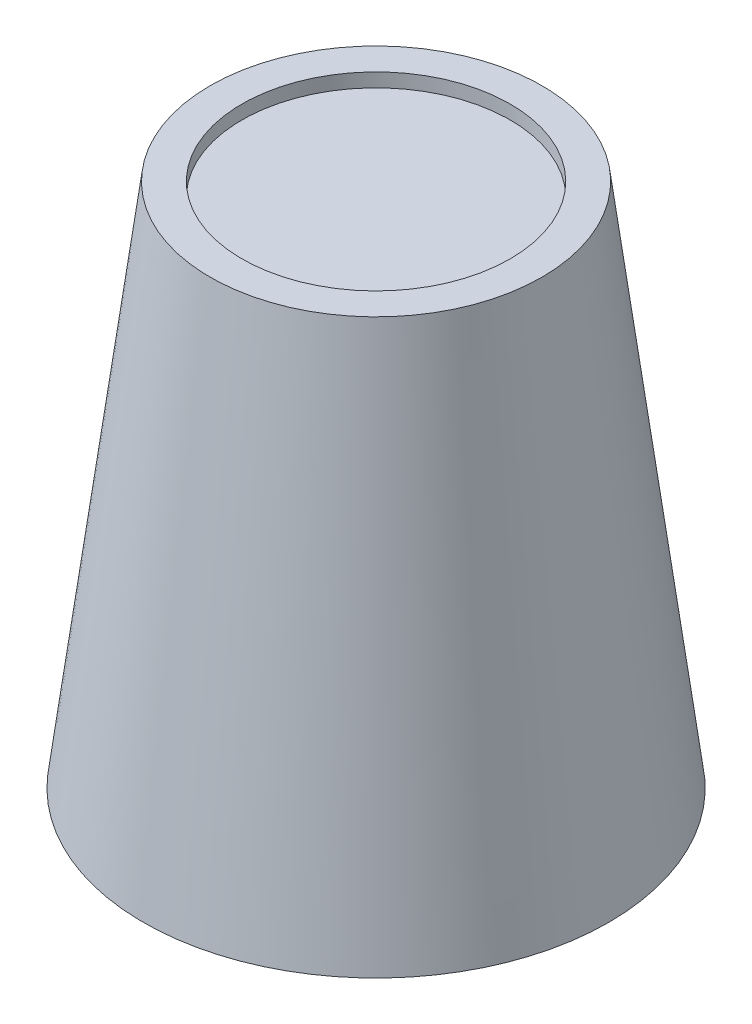
ISO-10303-21;
HEADER;
FILE_DESCRIPTION(('STEP AP214'),'2;1');
FILE_NAME('part.step','',(''),(''),'','','');
FILE_SCHEMA(('AUTOMOTIVE_DESIGN { 1 0 10303 214 1 1 1 1 }'));
ENDSEC;
DATA;
#1=APPLICATION_CONTEXT('core data for automotive mechanical design processes');
#2=APPLICATION_PROTOCOL_DEFINITION('international standard','automotive_design',2000,#1);
#3=PRODUCT_CONTEXT('',#1,'mechanical');
#4=PRODUCT('Part','Part','',(#3));
#5=PRODUCT_RELATED_PRODUCT_CATEGORY('part','',(#4));
#6=PRODUCT_DEFINITION_FORMATION('','',#4);
#7=PRODUCT_DEFINITION_CONTEXT('part definition',#1,'design');
#8=PRODUCT_DEFINITION('design','',#6,#7);
#9=PRODUCT_DEFINITION_SHAPE('','',#8);
#10=(LENGTH_UNIT() NAMED_UNIT(*) SI_UNIT(.MILLI.,.METRE.));
#11=(NAMED_UNIT(*) PLANE_ANGLE_UNIT() SI_UNIT($,.RADIAN.));
#12=(NAMED_UNIT(*) SI_UNIT($,.STERADIAN.) SOLID_ANGLE_UNIT());
#13=UNCERTAINTY_MEASURE_WITH_UNIT(LENGTH_MEASURE(1.E-05),#10,'distance_accuracy_value','');
#14=(GEOMETRIC_REPRESENTATION_CONTEXT(3) GLOBAL_UNCERTAINTY_ASSIGNED_CONTEXT((#13)) GLOBAL_UNIT_ASSIGNED_CONTEXT((#10,
#11,#12)) REPRESENTATION_CONTEXT('',''));
#15=CARTESIAN_POINT('',(0.,0.,0.));
#16=DIRECTION('',(0.,0.,1.));
#17=DIRECTION('',(1.,0.,0.));
#18=AXIS2_PLACEMENT_3D('',#15,#16,#17);
#19=CARTESIAN_POINT('',(3.49148133884313E-12,-1000.,0.));
#20=DIRECTION('',(0.,-1.,0.));
#21=DIRECTION('',(1.,0.,0.));
#22=AXIS2_PLACEMENT_3D('',#19,#20,#21);
#23=CYLINDRICAL_SURFACE('',#22,5.99999999999998);
#24=CARTESIAN_POINT('',(0.,-8.65364485422582,0.));
#25=DIRECTION('',(0.,-1.,0.));
#26=DIRECTION('',(1.,0.,0.));
#27=AXIS2_PLACEMENT_3D('',#24,#25,#26);
#28=CIRCLE('',#27,5.99999999999997);
#29=CARTESIAN_POINT('',(6.,-8.6536448542258,0.));
#30=VERTEX_POINT('',#29);
#31=EDGE_CURVE('E10',#30,#30,#28,.T.);
#32=ORIENTED_EDGE('',*,*,#31,.T.);
#33=EDGE_LOOP('',(#32));
#34=FACE_BOUND('',#33,.T.);
#35=CARTESIAN_POINT('',(0.,-5.15364485422576,0.));
#36=DIRECTION('',(0.,-1.,0.));
#37=DIRECTION('',(1.,0.,0.));
#38=AXIS2_PLACEMENT_3D('',#35,#36,#37);
#39=CIRCLE('',#38,5.99999999999998);
#40=CARTESIAN_POINT('',(6.,-5.15364485422574,0.));
#41=VERTEX_POINT('',#40);
#42=EDGE_CURVE('E67',#41,#41,#39,.T.);
#43=ORIENTED_EDGE('',*,*,#42,.F.);
#44=EDGE_LOOP('',(#43));
#45=FACE_BOUND('',#44,.T.);
#46=ADVANCED_FACE('F33',(#34,#45),#23,.F.);
#47=CARTESIAN_POINT('',(6.,-8.65364485422581,0.));
#48=DIRECTION('',(0.,-1.,0.));
#49=DIRECTION('',(1.,0.,0.));
#50=AXIS2_PLACEMENT_3D('',#47,#48,#49);
#51=PLANE('',#50);
#52=CARTESIAN_POINT('',(0.,-8.65364485422582,0.));
#53=DIRECTION('',(0.,-1.,0.));
#54=DIRECTION('',(1.,0.,0.));
#55=AXIS2_PLACEMENT_3D('',#52,#53,#54);
#56=CIRCLE('',#55,8.41700404858297);
#57=CARTESIAN_POINT('',(8.417004048583,-8.65364485422579,0.));
#58=VERTEX_POINT('',#57);
#59=EDGE_CURVE('E39',#58,#58,#56,.T.);
#60=ORIENTED_EDGE('',*,*,#59,.T.);
#61=EDGE_LOOP('',(#60));
#62=FACE_BOUND('',#61,.T.);
#63=ORIENTED_EDGE('',*,*,#31,.F.);
#64=EDGE_LOOP('',(#63));
#65=FACE_BOUND('',#64,.T.);
#66=ADVANCED_FACE('F75',(#62,#65),#51,.T.);
#67=CARTESIAN_POINT('',(0.,-8.65364485422582,0.));
#68=DIRECTION('',(0.,-1.,0.));
#69=DIRECTION('',(1.,0.,0.));
#70=AXIS2_PLACEMENT_3D('',#67,#68,#69);
#71=CONICAL_SURFACE('',#70,8.41700404858297,0.126531127028419);
#72=CARTESIAN_POINT('',(0.,10.3463551457741,0.));
#73=DIRECTION('',(0.,-1.,0.));
#74=DIRECTION('',(1.,0.,0.));
#75=AXIS2_PLACEMENT_3D('',#72,#73,#74);
#76=CIRCLE('',#75,6.00000000000004);
#77=CARTESIAN_POINT('',(6.,10.3463551457741,0.));
#78=VERTEX_POINT('',#77);
#79=EDGE_CURVE('E43',#78,#78,#76,.T.);
#80=ORIENTED_EDGE('',*,*,#79,.T.);
#81=EDGE_LOOP('',(#80));
#82=FACE_BOUND('',#81,.T.);
#83=ORIENTED_EDGE('',*,*,#59,.F.);
#84=EDGE_LOOP('',(#83));
#85=FACE_BOUND('',#84,.T.);
#86=ADVANCED_FACE('F79',(#82,#85),#71,.T.);
#87=CARTESIAN_POINT('',(6.,10.3463551457742,0.));
#88=DIRECTION('',(0.,1.,0.));
#89=DIRECTION('',(-1.,0.,0.));
#90=AXIS2_PLACEMENT_3D('',#87,#88,#89);
#91=PLANE('',#90);
#92=CARTESIAN_POINT('',(0.,10.3463551457741,0.));
#93=DIRECTION('',(0.,-1.,0.));
#94=DIRECTION('',(1.,0.,0.));
#95=AXIS2_PLACEMENT_3D('',#92,#93,#94);
#96=CIRCLE('',#95,4.85180912741404);
#97=CARTESIAN_POINT('',(4.85180912741401,10.3463551457741,0.));
#98=VERTEX_POINT('',#97);
#99=EDGE_CURVE('E47',#98,#98,#96,.T.);
#100=ORIENTED_EDGE('',*,*,#99,.T.);
#101=EDGE_LOOP('',(#100));
#102=FACE_BOUND('',#101,.T.);
#103=ORIENTED_EDGE('',*,*,#79,.F.);
#104=EDGE_LOOP('',(#103));
#105=FACE_BOUND('',#104,.T.);
#106=ADVANCED_FACE('F83',(#102,#105),#91,.T.);
#107=CARTESIAN_POINT('',(3.49148133884313E-12,-1000.,0.));
#108=DIRECTION('',(0.,-1.,0.));
#109=DIRECTION('',(1.,0.,0.));
#110=AXIS2_PLACEMENT_3D('',#107,#108,#109);
#111=CYLINDRICAL_SURFACE('',#110,4.85180912741404);
#112=CARTESIAN_POINT('',(0.,9.84635514577414,0.));
#113=DIRECTION('',(0.,-1.,0.));
#114=DIRECTION('',(1.,0.,0.));
#115=AXIS2_PLACEMENT_3D('',#112,#113,#114);
#116=CIRCLE('',#115,4.85180912741404);
#117=CARTESIAN_POINT('',(4.85180912741401,9.84635514577416,0.));
#118=VERTEX_POINT('',#117);
#119=EDGE_CURVE('E52',#118,#118,#116,.T.);
#120=ORIENTED_EDGE('',*,*,#119,.T.);
#121=EDGE_LOOP('',(#120));
#122=FACE_BOUND('',#121,.T.);
#123=ORIENTED_EDGE('',*,*,#99,.F.);
#124=EDGE_LOOP('',(#123));
#125=FACE_BOUND('',#124,.T.);
#126=ADVANCED_FACE('F90',(#122,#125),#111,.F.);
#127=CARTESIAN_POINT('',(0.,9.84635514577419,0.));
#128=DIRECTION('',(0.,1.,0.));
#129=DIRECTION('',(-1.,0.,0.));
#130=AXIS2_PLACEMENT_3D('',#127,#128,#129);
#131=PLANE('',#130);
#132=ORIENTED_EDGE('',*,*,#119,.F.);
#133=EDGE_LOOP('',(#132));
#134=FACE_BOUND('',#133,.T.);
#135=ADVANCED_FACE('F94',(#134),#131,.T.);
#136=CARTESIAN_POINT('',(1.5,9.3463551457742,0.));
#137=DIRECTION('',(0.,-1.,0.));
#138=DIRECTION('',(1.,0.,0.));
#139=AXIS2_PLACEMENT_3D('',#136,#137,#138);
#140=PLANE('',#139);
#141=CARTESIAN_POINT('',(0.,9.3463551457742,0.));
#142=DIRECTION('',(0.,-1.,0.));
#143=DIRECTION('',(1.,0.,0.));
#144=AXIS2_PLACEMENT_3D('',#141,#142,#143);
#145=CIRCLE('',#144,1.50000000000003);
#146=CARTESIAN_POINT('',(1.5,9.3463551457742,0.));
#147=VERTEX_POINT('',#146);
#148=EDGE_CURVE('E55',#147,#147,#145,.T.);
#149=ORIENTED_EDGE('',*,*,#148,.T.);
#150=EDGE_LOOP('',(#149));
#151=FACE_BOUND('',#150,.T.);
#152=ADVANCED_FACE('F98',(#151),#140,.T.);
#153=CARTESIAN_POINT('',(3.49148133884313E-12,-1000.,0.));
#154=DIRECTION('',(0.,-1.,0.));
#155=DIRECTION('',(1.,0.,0.));
#156=AXIS2_PLACEMENT_3D('',#153,#154,#155);
#157=CYLINDRICAL_SURFACE('',#156,1.50000000000001);
#158=CARTESIAN_POINT('',(0.,-3.15364485422576,0.));
#159=DIRECTION('',(0.,-1.,0.));
#160=DIRECTION('',(1.,0.,0.));
#161=AXIS2_PLACEMENT_3D('',#158,#159,#160);
#162=CIRCLE('',#161,1.49999999999999);
#163=CARTESIAN_POINT('',(1.5,-3.15364485422575,0.));
#164=VERTEX_POINT('',#163);
#165=EDGE_CURVE('E58',#164,#164,#162,.T.);
#166=ORIENTED_EDGE('',*,*,#165,.T.);
#167=EDGE_LOOP('',(#166));
#168=FACE_BOUND('',#167,.T.);
#169=ORIENTED_EDGE('',*,*,#148,.F.);
#170=EDGE_LOOP('',(#169));
#171=FACE_BOUND('',#170,.T.);
#172=ADVANCED_FACE('F102',(#168,#171),#157,.F.);
#173=CARTESIAN_POINT('',(1.5,-3.15364485422581,0.));
#174=DIRECTION('',(0.,-1.,0.));
#175=DIRECTION('',(1.,0.,0.));
#176=AXIS2_PLACEMENT_3D('',#173,#174,#175);
#177=PLANE('',#176);
#178=CARTESIAN_POINT('',(0.,-3.15364485422576,0.));
#179=DIRECTION('',(0.,-1.,0.));
#180=DIRECTION('',(1.,0.,0.));
#181=AXIS2_PLACEMENT_3D('',#178,#179,#180);
#182=CIRCLE('',#181,2.49999999999999);
#183=CARTESIAN_POINT('',(2.5,-3.15364485422575,0.));
#184=VERTEX_POINT('',#183);
#185=EDGE_CURVE('E61',#184,#184,#182,.T.);
#186=ORIENTED_EDGE('',*,*,#185,.T.);
#187=EDGE_LOOP('',(#186));
#188=FACE_BOUND('',#187,.T.);
#189=ORIENTED_EDGE('',*,*,#165,.F.);
#190=EDGE_LOOP('',(#189));
#191=FACE_BOUND('',#190,.T.);
#192=ADVANCED_FACE('F106',(#188,#191),#177,.T.);
#193=CARTESIAN_POINT('',(3.49148133884313E-12,-1000.,0.));
#194=DIRECTION('',(0.,-1.,0.));
#195=DIRECTION('',(1.,0.,0.));
#196=AXIS2_PLACEMENT_3D('',#193,#194,#195);
#197=CYLINDRICAL_SURFACE('',#196,2.49999999999999);
#198=CARTESIAN_POINT('',(0.,-5.15364485422576,0.));
#199=DIRECTION('',(0.,-1.,0.));
#200=DIRECTION('',(1.,0.,0.));
#201=AXIS2_PLACEMENT_3D('',#198,#199,#200);
#202=CIRCLE('',#201,2.49999999999998);
#203=CARTESIAN_POINT('',(2.5,-5.15364485422575,0.));
#204=VERTEX_POINT('',#203);
#205=EDGE_CURVE('E64',#204,#204,#202,.T.);
#206=ORIENTED_EDGE('',*,*,#205,.T.);
#207=EDGE_LOOP('',(#206));
#208=FACE_BOUND('',#207,.T.);
#209=ORIENTED_EDGE('',*,*,#185,.F.);
#210=EDGE_LOOP('',(#209));
#211=FACE_BOUND('',#210,.T.);
#212=ADVANCED_FACE('F110',(#208,#211),#197,.F.);
#213=CARTESIAN_POINT('',(6.,-5.1536448542258,0.));
#214=DIRECTION('',(0.,-1.,0.));
#215=DIRECTION('',(1.,0.,0.));
#216=AXIS2_PLACEMENT_3D('',#213,#214,#215);
#217=PLANE('',#216);
#218=ORIENTED_EDGE('',*,*,#42,.T.);
#219=EDGE_LOOP('',(#218));
#220=FACE_BOUND('',#219,.T.);
#221=ORIENTED_EDGE('',*,*,#205,.F.);
#222=EDGE_LOOP('',(#221));
#223=FACE_BOUND('',#222,.T.);
#224=ADVANCED_FACE('F71',(#220,#223),#217,.T.);
#225=CLOSED_SHELL('',(#46,#66,#86,#106,#126,#135,#152,#172,#192,#212,#224));
#226=MANIFOLD_SOLID_BREP('B2',#225);
#227=ADVANCED_BREP_SHAPE_REPRESENTATION('',(#18,#226),#14);
#228=SHAPE_DEFINITION_REPRESENTATION(#9,#227);
ENDSEC;
END-ISO-10303-21;
